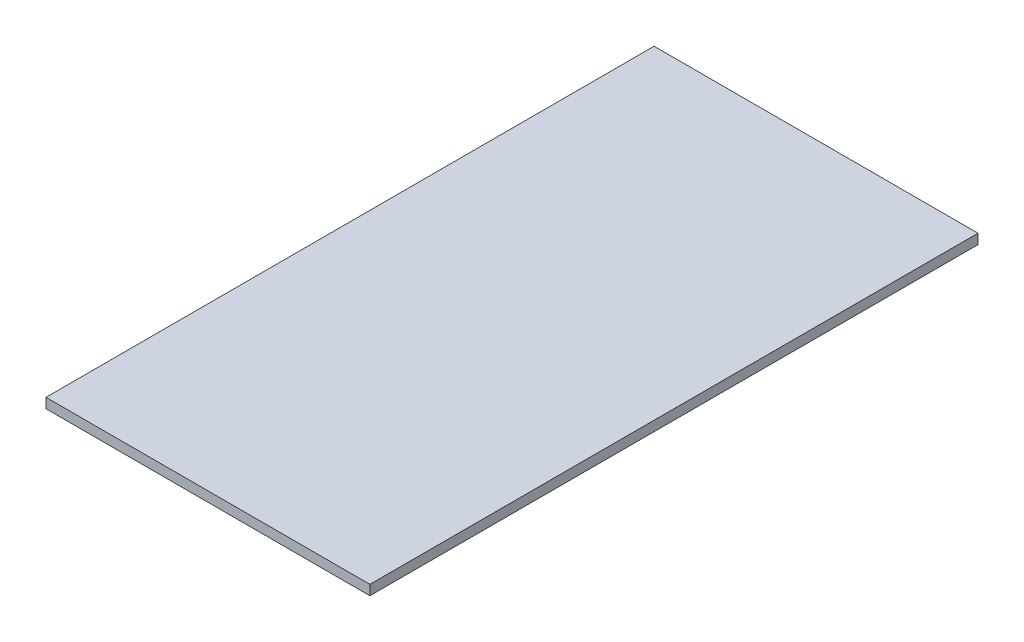
ISO-10303-21;
HEADER;
FILE_DESCRIPTION(('STEP AP214'),'2;1');
FILE_NAME('part.step','',(''),(''),'','','');
FILE_SCHEMA(('AUTOMOTIVE_DESIGN { 1 0 10303 214 1 1 1 1 }'));
ENDSEC;
DATA;
#1=APPLICATION_CONTEXT('core data for automotive mechanical design processes');
#2=APPLICATION_PROTOCOL_DEFINITION('international standard','automotive_design',2000,#1);
#3=PRODUCT_CONTEXT('',#1,'mechanical');
#4=PRODUCT('Part','Part','',(#3));
#5=PRODUCT_RELATED_PRODUCT_CATEGORY('part','',(#4));
#6=PRODUCT_DEFINITION_FORMATION('','',#4);
#7=PRODUCT_DEFINITION_CONTEXT('part definition',#1,'design');
#8=PRODUCT_DEFINITION('design','',#6,#7);
#9=PRODUCT_DEFINITION_SHAPE('','',#8);
#10=(LENGTH_UNIT() NAMED_UNIT(*) SI_UNIT(.MILLI.,.METRE.));
#11=(NAMED_UNIT(*) PLANE_ANGLE_UNIT() SI_UNIT($,.RADIAN.));
#12=(NAMED_UNIT(*) SI_UNIT($,.STERADIAN.) SOLID_ANGLE_UNIT());
#13=UNCERTAINTY_MEASURE_WITH_UNIT(LENGTH_MEASURE(1.E-05),#10,'distance_accuracy_value','');
#14=(GEOMETRIC_REPRESENTATION_CONTEXT(3) GLOBAL_UNCERTAINTY_ASSIGNED_CONTEXT((#13)) GLOBAL_UNIT_ASSIGNED_CONTEXT((#10,
#11,#12)) REPRESENTATION_CONTEXT('',''));
#15=CARTESIAN_POINT('',(0.,0.,0.));
#16=DIRECTION('',(0.,0.,1.));
#17=DIRECTION('',(1.,0.,0.));
#18=AXIS2_PLACEMENT_3D('',#15,#16,#17);
#19=CARTESIAN_POINT('',(0.,19.05,0.));
#20=DIRECTION('',(0.,1.,0.));
#21=DIRECTION('',(0.,0.,1.));
#22=AXIS2_PLACEMENT_3D('',#19,#20,#21);
#23=PLANE('',#22);
#24=DIRECTION('',(-1.,0.,0.));
#25=VECTOR('',#24,1.);
#26=CARTESIAN_POINT('',(311.15,19.05,-584.2));
#27=LINE('',#26,#25);
#28=CARTESIAN_POINT('',(-311.15,19.05,-584.2));
#29=VERTEX_POINT('',#28);
#30=CARTESIAN_POINT('',(311.15,19.05,-584.2));
#31=VERTEX_POINT('',#30);
#32=EDGE_CURVE('E67',#29,#31,#27,.F.);
#33=ORIENTED_EDGE('',*,*,#32,.F.);
#34=DIRECTION('',(0.,0.,1.));
#35=VECTOR('',#34,1.);
#36=CARTESIAN_POINT('',(-311.15,19.05,-584.2));
#37=LINE('',#36,#35);
#38=CARTESIAN_POINT('',(-311.15,19.05,584.2));
#39=VERTEX_POINT('',#38);
#40=EDGE_CURVE('E19',#39,#29,#37,.F.);
#41=ORIENTED_EDGE('',*,*,#40,.F.);
#42=DIRECTION('',(1.,0.,0.));
#43=VECTOR('',#42,1.);
#44=CARTESIAN_POINT('',(-311.15,19.05,584.2));
#45=LINE('',#44,#43);
#46=CARTESIAN_POINT('',(311.15,19.05,584.2));
#47=VERTEX_POINT('',#46);
#48=EDGE_CURVE('E57',#47,#39,#45,.F.);
#49=ORIENTED_EDGE('',*,*,#48,.F.);
#50=DIRECTION('',(0.,0.,-1.));
#51=VECTOR('',#50,1.);
#52=CARTESIAN_POINT('',(311.15,19.05,584.2));
#53=LINE('',#52,#51);
#54=EDGE_CURVE('E52',#31,#47,#53,.F.);
#55=ORIENTED_EDGE('',*,*,#54,.F.);
#56=EDGE_LOOP('',(#33,#41,#49,#55));
#57=FACE_BOUND('',#56,.T.);
#58=ADVANCED_FACE('F16',(#57),#23,.T.);
#59=CARTESIAN_POINT('',(-311.15,0.,-584.2));
#60=DIRECTION('',(-1.,0.,0.));
#61=DIRECTION('',(0.,0.,1.));
#62=AXIS2_PLACEMENT_3D('',#59,#60,#61);
#63=PLANE('',#62);
#64=DIRECTION('',(0.,1.,0.));
#65=VECTOR('',#64,1.);
#66=CARTESIAN_POINT('',(-311.15,0.,-584.2));
#67=LINE('',#66,#65);
#68=CARTESIAN_POINT('',(-311.15,0.,-584.2));
#69=VERTEX_POINT('',#68);
#70=EDGE_CURVE('E78',#69,#29,#67,.T.);
#71=ORIENTED_EDGE('',*,*,#70,.F.);
#72=DIRECTION('',(0.,0.,1.));
#73=VECTOR('',#72,1.);
#74=CARTESIAN_POINT('',(-311.15,0.,0.));
#75=LINE('',#74,#73);
#76=CARTESIAN_POINT('',(-311.15,0.,584.2));
#77=VERTEX_POINT('',#76);
#78=EDGE_CURVE('E73',#69,#77,#75,.T.);
#79=ORIENTED_EDGE('',*,*,#78,.T.);
#80=DIRECTION('',(0.,1.,0.));
#81=VECTOR('',#80,1.);
#82=CARTESIAN_POINT('',(-311.15,0.,584.2));
#83=LINE('',#82,#81);
#84=EDGE_CURVE('E62',#39,#77,#83,.F.);
#85=ORIENTED_EDGE('',*,*,#84,.F.);
#86=ORIENTED_EDGE('',*,*,#40,.T.);
#87=EDGE_LOOP('',(#71,#79,#85,#86));
#88=FACE_BOUND('',#87,.T.);
#89=ADVANCED_FACE('F72',(#88),#63,.T.);
#90=CARTESIAN_POINT('',(-311.15,0.,584.2));
#91=DIRECTION('',(0.,0.,1.));
#92=DIRECTION('',(1.,0.,0.));
#93=AXIS2_PLACEMENT_3D('',#90,#91,#92);
#94=PLANE('',#93);
#95=ORIENTED_EDGE('',*,*,#84,.T.);
#96=DIRECTION('',(1.,0.,0.));
#97=VECTOR('',#96,1.);
#98=CARTESIAN_POINT('',(0.,0.,584.2));
#99=LINE('',#98,#97);
#100=CARTESIAN_POINT('',(311.15,0.,584.2));
#101=VERTEX_POINT('',#100);
#102=EDGE_CURVE('E83',#77,#101,#99,.T.);
#103=ORIENTED_EDGE('',*,*,#102,.T.);
#104=DIRECTION('',(0.,1.,0.));
#105=VECTOR('',#104,1.);
#106=CARTESIAN_POINT('',(311.15,0.,584.2));
#107=LINE('',#106,#105);
#108=EDGE_CURVE('E64',#47,#101,#107,.F.);
#109=ORIENTED_EDGE('',*,*,#108,.F.);
#110=ORIENTED_EDGE('',*,*,#48,.T.);
#111=EDGE_LOOP('',(#95,#103,#109,#110));
#112=FACE_BOUND('',#111,.T.);
#113=ADVANCED_FACE('F59',(#112),#94,.T.);
#114=CARTESIAN_POINT('',(311.15,0.,584.2));
#115=DIRECTION('',(1.,0.,0.));
#116=DIRECTION('',(0.,0.,-1.));
#117=AXIS2_PLACEMENT_3D('',#114,#115,#116);
#118=PLANE('',#117);
#119=ORIENTED_EDGE('',*,*,#108,.T.);
#120=DIRECTION('',(0.,0.,1.));
#121=VECTOR('',#120,1.);
#122=CARTESIAN_POINT('',(311.15,0.,0.));
#123=LINE('',#122,#121);
#124=CARTESIAN_POINT('',(311.15,0.,-584.2));
#125=VERTEX_POINT('',#124);
#126=EDGE_CURVE('E25',#101,#125,#123,.F.);
#127=ORIENTED_EDGE('',*,*,#126,.T.);
#128=DIRECTION('',(0.,1.,0.));
#129=VECTOR('',#128,1.);
#130=CARTESIAN_POINT('',(311.15,0.,-584.2));
#131=LINE('',#130,#129);
#132=EDGE_CURVE('E33',#31,#125,#131,.F.);
#133=ORIENTED_EDGE('',*,*,#132,.F.);
#134=ORIENTED_EDGE('',*,*,#54,.T.);
#135=EDGE_LOOP('',(#119,#127,#133,#134));
#136=FACE_BOUND('',#135,.T.);
#137=ADVANCED_FACE('F87',(#136),#118,.T.);
#138=CARTESIAN_POINT('',(311.15,0.,-584.2));
#139=DIRECTION('',(0.,0.,-1.));
#140=DIRECTION('',(-1.,0.,0.));
#141=AXIS2_PLACEMENT_3D('',#138,#139,#140);
#142=PLANE('',#141);
#143=ORIENTED_EDGE('',*,*,#132,.T.);
#144=DIRECTION('',(1.,0.,0.));
#145=VECTOR('',#144,1.);
#146=CARTESIAN_POINT('',(0.,0.,-584.2));
#147=LINE('',#146,#145);
#148=EDGE_CURVE('E11',#125,#69,#147,.F.);
#149=ORIENTED_EDGE('',*,*,#148,.T.);
#150=ORIENTED_EDGE('',*,*,#70,.T.);
#151=ORIENTED_EDGE('',*,*,#32,.T.);
#152=EDGE_LOOP('',(#143,#149,#150,#151));
#153=FACE_BOUND('',#152,.T.);
#154=ADVANCED_FACE('F90',(#153),#142,.T.);
#155=CARTESIAN_POINT('',(0.,0.,0.));
#156=DIRECTION('',(0.,1.,0.));
#157=DIRECTION('',(0.,0.,1.));
#158=AXIS2_PLACEMENT_3D('',#155,#156,#157);
#159=PLANE('',#158);
#160=ORIENTED_EDGE('',*,*,#126,.F.);
#161=ORIENTED_EDGE('',*,*,#102,.F.);
#162=ORIENTED_EDGE('',*,*,#78,.F.);
#163=ORIENTED_EDGE('',*,*,#148,.F.);
#164=EDGE_LOOP('',(#160,#161,#162,#163));
#165=FACE_BOUND('',#164,.T.);
#166=ADVANCED_FACE('F89',(#165),#159,.F.);
#167=CLOSED_SHELL('',(#58,#89,#113,#137,#154,#166));
#168=MANIFOLD_SOLID_BREP('B1',#167);
#169=ADVANCED_BREP_SHAPE_REPRESENTATION('',(#18,#168),#14);
#170=SHAPE_DEFINITION_REPRESENTATION(#9,#169);
ENDSEC;
END-ISO-10303-21;
